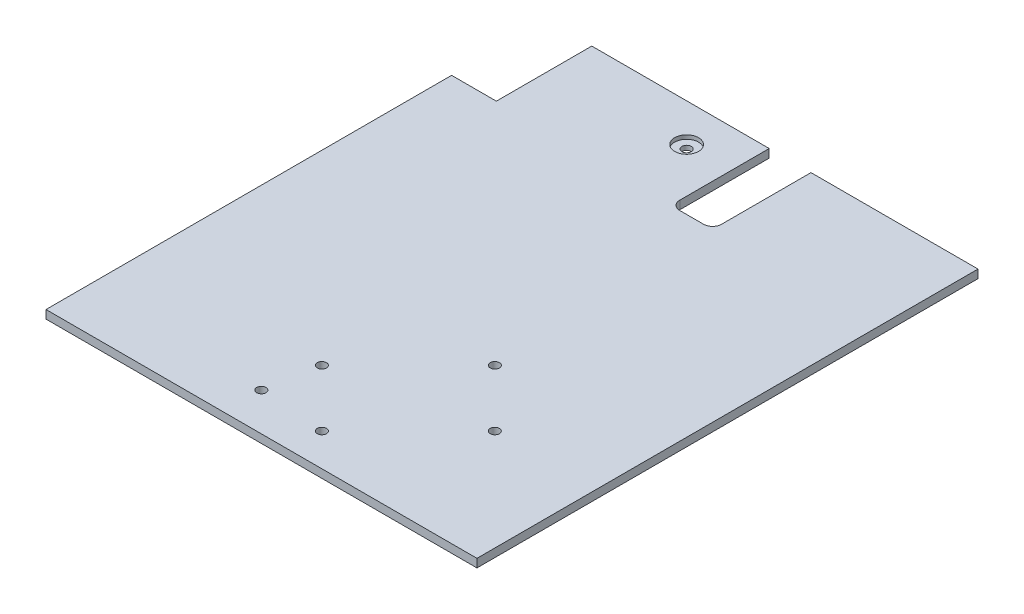
ISO-10303-21;
HEADER;
FILE_DESCRIPTION(('STEP AP214'),'2;1');
FILE_NAME('part.step','',(''),(''),'','','');
FILE_SCHEMA(('AUTOMOTIVE_DESIGN { 1 0 10303 214 1 1 1 1 }'));
ENDSEC;
DATA;
#1=APPLICATION_CONTEXT('core data for automotive mechanical design processes');
#2=APPLICATION_PROTOCOL_DEFINITION('international standard','automotive_design',2000,#1);
#3=PRODUCT_CONTEXT('',#1,'mechanical');
#4=PRODUCT('Part','Part','',(#3));
#5=PRODUCT_RELATED_PRODUCT_CATEGORY('part','',(#4));
#6=PRODUCT_DEFINITION_FORMATION('','',#4);
#7=PRODUCT_DEFINITION_CONTEXT('part definition',#1,'design');
#8=PRODUCT_DEFINITION('design','',#6,#7);
#9=PRODUCT_DEFINITION_SHAPE('','',#8);
#10=(LENGTH_UNIT() NAMED_UNIT(*) SI_UNIT(.MILLI.,.METRE.));
#11=(NAMED_UNIT(*) PLANE_ANGLE_UNIT() SI_UNIT($,.RADIAN.));
#12=(NAMED_UNIT(*) SI_UNIT($,.STERADIAN.) SOLID_ANGLE_UNIT());
#13=UNCERTAINTY_MEASURE_WITH_UNIT(LENGTH_MEASURE(1.E-05),#10,'distance_accuracy_value','');
#14=(GEOMETRIC_REPRESENTATION_CONTEXT(3) GLOBAL_UNCERTAINTY_ASSIGNED_CONTEXT((#13)) GLOBAL_UNIT_ASSIGNED_CONTEXT((#10,
#11,#12)) REPRESENTATION_CONTEXT('',''));
#15=CARTESIAN_POINT('',(0.,0.,0.));
#16=DIRECTION('',(0.,0.,1.));
#17=DIRECTION('',(1.,0.,0.));
#18=AXIS2_PLACEMENT_3D('',#15,#16,#17);
#19=CARTESIAN_POINT('',(0.,2.8,-84.));
#20=DIRECTION('',(0.,0.,-1.));
#21=DIRECTION('',(-1.,0.,0.));
#22=AXIS2_PLACEMENT_3D('',#19,#20,#21);
#23=PLANE('',#22);
#24=DIRECTION('',(0.,1.,0.));
#25=VECTOR('',#24,1.);
#26=CARTESIAN_POINT('',(16.25,-0.00100000000000013,-84.));
#27=LINE('',#26,#25);
#28=CARTESIAN_POINT('',(16.25,0.,-84.));
#29=VERTEX_POINT('',#28);
#30=CARTESIAN_POINT('',(16.25,2.8,-84.));
#31=VERTEX_POINT('',#30);
#32=EDGE_CURVE('E247',#29,#31,#27,.T.);
#33=ORIENTED_EDGE('',*,*,#32,.T.);
#34=DIRECTION('',(1.,0.,0.));
#35=VECTOR('',#34,1.);
#36=CARTESIAN_POINT('',(0.,2.8,-84.));
#37=LINE('',#36,#35);
#38=CARTESIAN_POINT('',(72.25,2.8,-84.));
#39=VERTEX_POINT('',#38);
#40=EDGE_CURVE('E59',#31,#39,#37,.T.);
#41=ORIENTED_EDGE('',*,*,#40,.T.);
#42=DIRECTION('',(0.,-1.,0.));
#43=VECTOR('',#42,1.);
#44=CARTESIAN_POINT('',(72.25,2.8,-84.));
#45=LINE('',#44,#43);
#46=CARTESIAN_POINT('',(72.25,0.,-84.));
#47=VERTEX_POINT('',#46);
#48=EDGE_CURVE('E138',#39,#47,#45,.T.);
#49=ORIENTED_EDGE('',*,*,#48,.T.);
#50=DIRECTION('',(1.,0.,0.));
#51=VECTOR('',#50,1.);
#52=CARTESIAN_POINT('',(0.,0.,-84.));
#53=LINE('',#52,#51);
#54=EDGE_CURVE('E86',#29,#47,#53,.T.);
#55=ORIENTED_EDGE('',*,*,#54,.F.);
#56=EDGE_LOOP('',(#33,#41,#49,#55));
#57=FACE_BOUND('',#56,.T.);
#58=ADVANCED_FACE('F34',(#57),#23,.T.);
#59=CARTESIAN_POINT('',(-12.75,-0.00100000000000013,-71.3));
#60=DIRECTION('',(0.,1.,0.));
#61=DIRECTION('',(0.,0.,1.));
#62=AXIS2_PLACEMENT_3D('',#59,#60,#61);
#63=CYLINDRICAL_SURFACE('',#62,1.54999999999999);
#64=CARTESIAN_POINT('',(-12.75,0.,-71.3));
#65=DIRECTION('',(0.,1.,0.));
#66=DIRECTION('',(0.,0.,1.));
#67=AXIS2_PLACEMENT_3D('',#64,#65,#66);
#68=CIRCLE('',#67,1.54999999999999);
#69=CARTESIAN_POINT('',(-12.75,0.,-69.75));
#70=VERTEX_POINT('',#69);
#71=EDGE_CURVE('E143',#70,#70,#68,.F.);
#72=ORIENTED_EDGE('',*,*,#71,.T.);
#73=EDGE_LOOP('',(#72));
#74=FACE_BOUND('',#73,.T.);
#75=CARTESIAN_POINT('',(-12.75,1.5,-71.3));
#76=DIRECTION('',(0.,1.,0.));
#77=DIRECTION('',(0.,0.,1.));
#78=AXIS2_PLACEMENT_3D('',#75,#76,#77);
#79=CIRCLE('',#78,1.54999999999999);
#80=CARTESIAN_POINT('',(-12.75,1.5,-69.75));
#81=VERTEX_POINT('',#80);
#82=EDGE_CURVE('E38',#81,#81,#79,.F.);
#83=ORIENTED_EDGE('',*,*,#82,.F.);
#84=EDGE_LOOP('',(#83));
#85=FACE_BOUND('',#84,.T.);
#86=ADVANCED_FACE('F317',(#74,#85),#63,.F.);
#87=DIRECTION('',(0.,1.,0.));
#88=VECTOR('',#87,1.);
#89=CARTESIAN_POINT('',(2.24999999999999,-0.00100000000000013,-84.));
#90=LINE('',#89,#88);
#91=CARTESIAN_POINT('',(2.24999999999999,0.,-84.));
#92=VERTEX_POINT('',#91);
#93=CARTESIAN_POINT('',(2.24999999999999,2.8,-84.));
#94=VERTEX_POINT('',#93);
#95=EDGE_CURVE('E207',#92,#94,#90,.T.);
#96=ORIENTED_EDGE('',*,*,#95,.F.);
#97=CARTESIAN_POINT('',(-57.25,0.,-84.));
#98=VERTEX_POINT('',#97);
#99=EDGE_CURVE('E152',#98,#92,#53,.T.);
#100=ORIENTED_EDGE('',*,*,#99,.F.);
#101=DIRECTION('',(0.,-1.,0.));
#102=VECTOR('',#101,1.);
#103=CARTESIAN_POINT('',(-57.25,2.8,-84.));
#104=LINE('',#103,#102);
#105=CARTESIAN_POINT('',(-57.25,2.8,-84.));
#106=VERTEX_POINT('',#105);
#107=EDGE_CURVE('E11',#106,#98,#104,.T.);
#108=ORIENTED_EDGE('',*,*,#107,.F.);
#109=EDGE_CURVE('E191',#106,#94,#37,.T.);
#110=ORIENTED_EDGE('',*,*,#109,.T.);
#111=EDGE_LOOP('',(#96,#100,#108,#110));
#112=FACE_BOUND('',#111,.T.);
#113=ADVANCED_FACE('F204',(#112),#23,.T.);
#114=CARTESIAN_POINT('',(-57.25,2.8,0.));
#115=DIRECTION('',(1.,0.,0.));
#116=DIRECTION('',(0.,0.,-1.));
#117=AXIS2_PLACEMENT_3D('',#114,#115,#116);
#118=PLANE('',#117);
#119=DIRECTION('',(0.,0.,1.));
#120=VECTOR('',#119,1.);
#121=CARTESIAN_POINT('',(-57.25,0.,0.));
#122=LINE('',#121,#120);
#123=CARTESIAN_POINT('',(-57.25,0.,-52.));
#124=VERTEX_POINT('',#123);
#125=EDGE_CURVE('E155',#98,#124,#122,.T.);
#126=ORIENTED_EDGE('',*,*,#125,.T.);
#127=DIRECTION('',(0.,-1.,0.));
#128=VECTOR('',#127,1.);
#129=CARTESIAN_POINT('',(-57.25,2.8,-52.));
#130=LINE('',#129,#128);
#131=CARTESIAN_POINT('',(-57.25,2.8,-52.));
#132=VERTEX_POINT('',#131);
#133=EDGE_CURVE('E43',#132,#124,#130,.T.);
#134=ORIENTED_EDGE('',*,*,#133,.F.);
#135=DIRECTION('',(0.,0.,1.));
#136=VECTOR('',#135,1.);
#137=CARTESIAN_POINT('',(-57.25,2.8,0.));
#138=LINE('',#137,#136);
#139=EDGE_CURVE('E133',#106,#132,#138,.T.);
#140=ORIENTED_EDGE('',*,*,#139,.F.);
#141=ORIENTED_EDGE('',*,*,#107,.T.);
#142=EDGE_LOOP('',(#126,#134,#140,#141));
#143=FACE_BOUND('',#142,.T.);
#144=ADVANCED_FACE('F177',(#143),#118,.F.);
#145=CARTESIAN_POINT('',(0.,2.8,-52.));
#146=DIRECTION('',(0.,0.,-1.));
#147=DIRECTION('',(-1.,0.,0.));
#148=AXIS2_PLACEMENT_3D('',#145,#146,#147);
#149=PLANE('',#148);
#150=DIRECTION('',(1.,0.,0.));
#151=VECTOR('',#150,1.);
#152=CARTESIAN_POINT('',(0.,0.,-52.));
#153=LINE('',#152,#151);
#154=CARTESIAN_POINT('',(-72.25,0.,-52.));
#155=VERTEX_POINT('',#154);
#156=EDGE_CURVE('E158',#155,#124,#153,.T.);
#157=ORIENTED_EDGE('',*,*,#156,.F.);
#158=DIRECTION('',(0.,-1.,0.));
#159=VECTOR('',#158,1.);
#160=CARTESIAN_POINT('',(-72.25,2.8,-52.));
#161=LINE('',#160,#159);
#162=CARTESIAN_POINT('',(-72.25,2.8,-52.));
#163=VERTEX_POINT('',#162);
#164=EDGE_CURVE('E115',#163,#155,#161,.T.);
#165=ORIENTED_EDGE('',*,*,#164,.F.);
#166=DIRECTION('',(1.,0.,0.));
#167=VECTOR('',#166,1.);
#168=CARTESIAN_POINT('',(0.,2.8,-52.));
#169=LINE('',#168,#167);
#170=EDGE_CURVE('E131',#163,#132,#169,.T.);
#171=ORIENTED_EDGE('',*,*,#170,.T.);
#172=ORIENTED_EDGE('',*,*,#133,.T.);
#173=EDGE_LOOP('',(#157,#165,#171,#172));
#174=FACE_BOUND('',#173,.T.);
#175=ADVANCED_FACE('F174',(#174),#149,.T.);
#176=CARTESIAN_POINT('',(-72.25,2.8,0.));
#177=DIRECTION('',(-1.,0.,0.));
#178=DIRECTION('',(0.,0.,1.));
#179=AXIS2_PLACEMENT_3D('',#176,#177,#178);
#180=PLANE('',#179);
#181=DIRECTION('',(0.,0.,-1.));
#182=VECTOR('',#181,1.);
#183=CARTESIAN_POINT('',(-72.25,0.,0.));
#184=LINE('',#183,#182);
#185=CARTESIAN_POINT('',(-72.25,0.,84.));
#186=VERTEX_POINT('',#185);
#187=EDGE_CURVE('E111',#186,#155,#184,.T.);
#188=ORIENTED_EDGE('',*,*,#187,.F.);
#189=DIRECTION('',(0.,-1.,0.));
#190=VECTOR('',#189,1.);
#191=CARTESIAN_POINT('',(-72.25,2.8,84.));
#192=LINE('',#191,#190);
#193=CARTESIAN_POINT('',(-72.25,2.8,84.));
#194=VERTEX_POINT('',#193);
#195=EDGE_CURVE('E105',#194,#186,#192,.T.);
#196=ORIENTED_EDGE('',*,*,#195,.F.);
#197=DIRECTION('',(0.,0.,-1.));
#198=VECTOR('',#197,1.);
#199=CARTESIAN_POINT('',(-72.25,2.8,0.));
#200=LINE('',#199,#198);
#201=EDGE_CURVE('E109',#194,#163,#200,.T.);
#202=ORIENTED_EDGE('',*,*,#201,.T.);
#203=ORIENTED_EDGE('',*,*,#164,.T.);
#204=EDGE_LOOP('',(#188,#196,#202,#203));
#205=FACE_BOUND('',#204,.T.);
#206=ADVANCED_FACE('F107',(#205),#180,.T.);
#207=CARTESIAN_POINT('',(0.,2.8,84.));
#208=DIRECTION('',(0.,0.,-1.));
#209=DIRECTION('',(-1.,0.,0.));
#210=AXIS2_PLACEMENT_3D('',#207,#208,#209);
#211=PLANE('',#210);
#212=DIRECTION('',(1.,0.,0.));
#213=VECTOR('',#212,1.);
#214=CARTESIAN_POINT('',(0.,0.,84.));
#215=LINE('',#214,#213);
#216=CARTESIAN_POINT('',(72.25,0.,84.));
#217=VERTEX_POINT('',#216);
#218=EDGE_CURVE('E162',#186,#217,#215,.T.);
#219=ORIENTED_EDGE('',*,*,#218,.T.);
#220=DIRECTION('',(0.,-1.,0.));
#221=VECTOR('',#220,1.);
#222=CARTESIAN_POINT('',(72.25,2.8,84.));
#223=LINE('',#222,#221);
#224=CARTESIAN_POINT('',(72.25,2.8,84.));
#225=VERTEX_POINT('',#224);
#226=EDGE_CURVE('E116',#225,#217,#223,.T.);
#227=ORIENTED_EDGE('',*,*,#226,.F.);
#228=DIRECTION('',(1.,0.,0.));
#229=VECTOR('',#228,1.);
#230=CARTESIAN_POINT('',(0.,2.8,84.));
#231=LINE('',#230,#229);
#232=EDGE_CURVE('E120',#194,#225,#231,.T.);
#233=ORIENTED_EDGE('',*,*,#232,.F.);
#234=ORIENTED_EDGE('',*,*,#195,.T.);
#235=EDGE_LOOP('',(#219,#227,#233,#234));
#236=FACE_BOUND('',#235,.T.);
#237=ADVANCED_FACE('F121',(#236),#211,.F.);
#238=CARTESIAN_POINT('',(19.1997474683059,2.8,24.9583694396574));
#239=DIRECTION('',(0.,-1.,0.));
#240=DIRECTION('',(0.,0.,-1.));
#241=AXIS2_PLACEMENT_3D('',#238,#239,#240);
#242=CYLINDRICAL_SURFACE('',#241,1.55);
#243=CARTESIAN_POINT('',(19.1997474683059,2.8,24.9583694396574));
#244=DIRECTION('',(0.,1.,0.));
#245=DIRECTION('',(0.,0.,1.));
#246=AXIS2_PLACEMENT_3D('',#243,#244,#245);
#247=CIRCLE('',#246,1.55);
#248=CARTESIAN_POINT('',(19.1997474683059,2.8,26.5083694396574));
#249=VERTEX_POINT('',#248);
#250=EDGE_CURVE('E192',#249,#249,#247,.T.);
#251=ORIENTED_EDGE('',*,*,#250,.T.);
#252=EDGE_LOOP('',(#251));
#253=FACE_BOUND('',#252,.T.);
#254=CARTESIAN_POINT('',(19.1997474683059,0.,24.9583694396574));
#255=DIRECTION('',(0.,1.,0.));
#256=DIRECTION('',(0.,0.,1.));
#257=AXIS2_PLACEMENT_3D('',#254,#255,#256);
#258=CIRCLE('',#257,1.55);
#259=CARTESIAN_POINT('',(19.1997474683059,0.,26.5083694396574));
#260=VERTEX_POINT('',#259);
#261=EDGE_CURVE('E149',#260,#260,#258,.T.);
#262=ORIENTED_EDGE('',*,*,#261,.F.);
#263=EDGE_LOOP('',(#262));
#264=FACE_BOUND('',#263,.T.);
#265=ADVANCED_FACE('F297',(#253,#264),#242,.F.);
#266=CARTESIAN_POINT('',(38.2916305603426,2.8,44.0502525316942));
#267=DIRECTION('',(0.,-1.,0.));
#268=DIRECTION('',(0.,0.,-1.));
#269=AXIS2_PLACEMENT_3D('',#266,#267,#268);
#270=CYLINDRICAL_SURFACE('',#269,1.55);
#271=CARTESIAN_POINT('',(38.2916305603426,2.8,44.0502525316942));
#272=DIRECTION('',(0.,1.,0.));
#273=DIRECTION('',(0.,0.,1.));
#274=AXIS2_PLACEMENT_3D('',#271,#272,#273);
#275=CIRCLE('',#274,1.55);
#276=CARTESIAN_POINT('',(38.2916305603426,2.8,45.6002525316942));
#277=VERTEX_POINT('',#276);
#278=EDGE_CURVE('E195',#277,#277,#275,.T.);
#279=ORIENTED_EDGE('',*,*,#278,.T.);
#280=EDGE_LOOP('',(#279));
#281=FACE_BOUND('',#280,.T.);
#282=CARTESIAN_POINT('',(38.2916305603426,0.,44.0502525316942));
#283=DIRECTION('',(0.,1.,0.));
#284=DIRECTION('',(0.,0.,1.));
#285=AXIS2_PLACEMENT_3D('',#282,#283,#284);
#286=CIRCLE('',#285,1.55);
#287=CARTESIAN_POINT('',(38.2916305603426,0.,45.6002525316942));
#288=VERTEX_POINT('',#287);
#289=EDGE_CURVE('E146',#288,#288,#286,.T.);
#290=ORIENTED_EDGE('',*,*,#289,.F.);
#291=EDGE_LOOP('',(#290));
#292=FACE_BOUND('',#291,.T.);
#293=ADVANCED_FACE('F289',(#281,#292),#270,.F.);
#294=CARTESIAN_POINT('',(-9.79163056034263,2.8,53.9497474683058));
#295=DIRECTION('',(0.,-1.,0.));
#296=DIRECTION('',(0.,0.,-1.));
#297=AXIS2_PLACEMENT_3D('',#294,#295,#296);
#298=CYLINDRICAL_SURFACE('',#297,1.55);
#299=CARTESIAN_POINT('',(-9.79163056034263,2.8,53.9497474683058));
#300=DIRECTION('',(0.,1.,0.));
#301=DIRECTION('',(0.,0.,1.));
#302=AXIS2_PLACEMENT_3D('',#299,#300,#301);
#303=CIRCLE('',#302,1.55);
#304=CARTESIAN_POINT('',(-9.79163056034263,2.8,55.4997474683058));
#305=VERTEX_POINT('',#304);
#306=EDGE_CURVE('E284',#305,#305,#303,.T.);
#307=ORIENTED_EDGE('',*,*,#306,.T.);
#308=EDGE_LOOP('',(#307));
#309=FACE_BOUND('',#308,.T.);
#310=CARTESIAN_POINT('',(-9.79163056034263,0.,53.9497474683058));
#311=DIRECTION('',(0.,1.,0.));
#312=DIRECTION('',(0.,0.,1.));
#313=AXIS2_PLACEMENT_3D('',#310,#311,#312);
#314=CIRCLE('',#313,1.55);
#315=CARTESIAN_POINT('',(-9.79163056034263,0.,55.4997474683058));
#316=VERTEX_POINT('',#315);
#317=EDGE_CURVE('E142',#316,#316,#314,.T.);
#318=ORIENTED_EDGE('',*,*,#317,.F.);
#319=EDGE_LOOP('',(#318));
#320=FACE_BOUND('',#319,.T.);
#321=ADVANCED_FACE('F341',(#309,#320),#298,.F.);
#322=CARTESIAN_POINT('',(9.30025253169412,2.8,73.0416305603426));
#323=DIRECTION('',(0.,-1.,0.));
#324=DIRECTION('',(0.,0.,-1.));
#325=AXIS2_PLACEMENT_3D('',#322,#323,#324);
#326=CYLINDRICAL_SURFACE('',#325,1.55);
#327=CARTESIAN_POINT('',(9.30025253169412,2.8,73.0416305603426));
#328=DIRECTION('',(0.,1.,0.));
#329=DIRECTION('',(0.,0.,1.));
#330=AXIS2_PLACEMENT_3D('',#327,#328,#329);
#331=CIRCLE('',#330,1.55);
#332=CARTESIAN_POINT('',(9.30025253169412,2.8,74.5916305603426));
#333=VERTEX_POINT('',#332);
#334=EDGE_CURVE('E167',#333,#333,#331,.T.);
#335=ORIENTED_EDGE('',*,*,#334,.T.);
#336=EDGE_LOOP('',(#335));
#337=FACE_BOUND('',#336,.T.);
#338=CARTESIAN_POINT('',(9.30025253169412,0.,73.0416305603426));
#339=DIRECTION('',(0.,1.,0.));
#340=DIRECTION('',(0.,0.,1.));
#341=AXIS2_PLACEMENT_3D('',#338,#339,#340);
#342=CIRCLE('',#341,1.55);
#343=CARTESIAN_POINT('',(9.30025253169412,0.,74.5916305603426));
#344=VERTEX_POINT('',#343);
#345=EDGE_CURVE('E139',#344,#344,#342,.T.);
#346=ORIENTED_EDGE('',*,*,#345,.F.);
#347=EDGE_LOOP('',(#346));
#348=FACE_BOUND('',#347,.T.);
#349=ADVANCED_FACE('F36',(#337,#348),#326,.F.);
#350=CARTESIAN_POINT('',(72.25,2.8,0.));
#351=DIRECTION('',(-1.,0.,0.));
#352=DIRECTION('',(0.,0.,1.));
#353=AXIS2_PLACEMENT_3D('',#350,#351,#352);
#354=PLANE('',#353);
#355=DIRECTION('',(0.,0.,-1.));
#356=VECTOR('',#355,1.);
#357=CARTESIAN_POINT('',(72.25,0.,0.));
#358=LINE('',#357,#356);
#359=EDGE_CURVE('E164',#217,#47,#358,.T.);
#360=ORIENTED_EDGE('',*,*,#359,.T.);
#361=ORIENTED_EDGE('',*,*,#48,.F.);
#362=DIRECTION('',(0.,0.,-1.));
#363=VECTOR('',#362,1.);
#364=CARTESIAN_POINT('',(72.25,2.8,0.));
#365=LINE('',#364,#363);
#366=EDGE_CURVE('E124',#225,#39,#365,.T.);
#367=ORIENTED_EDGE('',*,*,#366,.F.);
#368=ORIENTED_EDGE('',*,*,#226,.T.);
#369=EDGE_LOOP('',(#360,#361,#367,#368));
#370=FACE_BOUND('',#369,.T.);
#371=ADVANCED_FACE('F182',(#370),#354,.F.);
#372=CARTESIAN_POINT('',(0.,2.8,0.));
#373=DIRECTION('',(0.,1.,0.));
#374=DIRECTION('',(0.,0.,1.));
#375=AXIS2_PLACEMENT_3D('',#372,#373,#374);
#376=PLANE('',#375);
#377=DIRECTION('',(0.,0.,-1.));
#378=VECTOR('',#377,1.);
#379=CARTESIAN_POINT('',(16.25,2.8,-84.));
#380=LINE('',#379,#378);
#381=CARTESIAN_POINT('',(16.25,2.8,-54.));
#382=VERTEX_POINT('',#381);
#383=EDGE_CURVE('E187',#382,#31,#380,.T.);
#384=ORIENTED_EDGE('',*,*,#383,.F.);
#385=CARTESIAN_POINT('',(13.25,2.8,-54.));
#386=DIRECTION('',(0.,1.,0.));
#387=DIRECTION('',(0.,0.,-1.));
#388=AXIS2_PLACEMENT_3D('',#385,#386,#387);
#389=CIRCLE('',#388,3.);
#390=CARTESIAN_POINT('',(13.25,2.8,-51.));
#391=VERTEX_POINT('',#390);
#392=EDGE_CURVE('E240',#391,#382,#389,.T.);
#393=ORIENTED_EDGE('',*,*,#392,.F.);
#394=DIRECTION('',(1.,0.,0.));
#395=VECTOR('',#394,1.);
#396=CARTESIAN_POINT('',(13.25,2.8,-51.));
#397=LINE('',#396,#395);
#398=CARTESIAN_POINT('',(5.25,2.8,-51.));
#399=VERTEX_POINT('',#398);
#400=EDGE_CURVE('E259',#399,#391,#397,.T.);
#401=ORIENTED_EDGE('',*,*,#400,.F.);
#402=CARTESIAN_POINT('',(5.25,2.8,-54.));
#403=DIRECTION('',(0.,1.,0.));
#404=DIRECTION('',(0.,0.,1.));
#405=AXIS2_PLACEMENT_3D('',#402,#403,#404);
#406=CIRCLE('',#405,3.);
#407=CARTESIAN_POINT('',(2.25,2.8,-54.));
#408=VERTEX_POINT('',#407);
#409=EDGE_CURVE('E256',#408,#399,#406,.T.);
#410=ORIENTED_EDGE('',*,*,#409,.F.);
#411=DIRECTION('',(0.,0.,1.));
#412=VECTOR('',#411,1.);
#413=CARTESIAN_POINT('',(2.24999999999999,2.8,-84.));
#414=LINE('',#413,#412);
#415=EDGE_CURVE('E202',#94,#408,#414,.T.);
#416=ORIENTED_EDGE('',*,*,#415,.F.);
#417=ORIENTED_EDGE('',*,*,#109,.F.);
#418=ORIENTED_EDGE('',*,*,#139,.T.);
#419=ORIENTED_EDGE('',*,*,#170,.F.);
#420=ORIENTED_EDGE('',*,*,#201,.F.);
#421=ORIENTED_EDGE('',*,*,#232,.T.);
#422=ORIENTED_EDGE('',*,*,#366,.T.);
#423=ORIENTED_EDGE('',*,*,#40,.F.);
#424=EDGE_LOOP('',(#384,#393,#401,#410,#416,#417,#418,#419,#420,#421,#422,#423));
#425=FACE_BOUND('',#424,.T.);
#426=CARTESIAN_POINT('',(-12.75,2.8,-71.3));
#427=DIRECTION('',(0.,1.,0.));
#428=DIRECTION('',(0.,0.,1.));
#429=AXIS2_PLACEMENT_3D('',#426,#427,#428);
#430=CIRCLE('',#429,4.);
#431=CARTESIAN_POINT('',(-12.75,2.8,-67.3));
#432=VERTEX_POINT('',#431);
#433=EDGE_CURVE('E242',#432,#432,#430,.T.);
#434=ORIENTED_EDGE('',*,*,#433,.F.);
#435=EDGE_LOOP('',(#434));
#436=FACE_BOUND('',#435,.T.);
#437=CARTESIAN_POINT('',(-12.75,2.8,71.3));
#438=DIRECTION('',(0.,1.,0.));
#439=DIRECTION('',(0.,0.,1.));
#440=AXIS2_PLACEMENT_3D('',#437,#438,#439);
#441=CIRCLE('',#440,1.55);
#442=CARTESIAN_POINT('',(-12.75,2.8,72.85));
#443=VERTEX_POINT('',#442);
#444=EDGE_CURVE('E277',#443,#443,#441,.T.);
#445=ORIENTED_EDGE('',*,*,#444,.F.);
#446=EDGE_LOOP('',(#445));
#447=FACE_BOUND('',#446,.T.);
#448=ORIENTED_EDGE('',*,*,#334,.F.);
#449=EDGE_LOOP('',(#448));
#450=FACE_BOUND('',#449,.T.);
#451=ORIENTED_EDGE('',*,*,#306,.F.);
#452=EDGE_LOOP('',(#451));
#453=FACE_BOUND('',#452,.T.);
#454=ORIENTED_EDGE('',*,*,#278,.F.);
#455=EDGE_LOOP('',(#454));
#456=FACE_BOUND('',#455,.T.);
#457=ORIENTED_EDGE('',*,*,#250,.F.);
#458=EDGE_LOOP('',(#457));
#459=FACE_BOUND('',#458,.T.);
#460=ADVANCED_FACE('F128',(#425,#436,#447,#450,#453,#456,#459),#376,.T.);
#461=CARTESIAN_POINT('',(0.,0.,0.));
#462=DIRECTION('',(0.,1.,0.));
#463=DIRECTION('',(0.,0.,1.));
#464=AXIS2_PLACEMENT_3D('',#461,#462,#463);
#465=PLANE('',#464);
#466=ORIENTED_EDGE('',*,*,#71,.F.);
#467=EDGE_LOOP('',(#466));
#468=FACE_BOUND('',#467,.T.);
#469=CARTESIAN_POINT('',(-12.75,0.,71.3));
#470=DIRECTION('',(0.,1.,0.));
#471=DIRECTION('',(0.,0.,1.));
#472=AXIS2_PLACEMENT_3D('',#469,#470,#471);
#473=CIRCLE('',#472,1.55);
#474=CARTESIAN_POINT('',(-12.75,0.,72.85));
#475=VERTEX_POINT('',#474);
#476=EDGE_CURVE('E276',#475,#475,#473,.F.);
#477=ORIENTED_EDGE('',*,*,#476,.F.);
#478=EDGE_LOOP('',(#477));
#479=FACE_BOUND('',#478,.T.);
#480=ORIENTED_EDGE('',*,*,#345,.T.);
#481=EDGE_LOOP('',(#480));
#482=FACE_BOUND('',#481,.T.);
#483=ORIENTED_EDGE('',*,*,#317,.T.);
#484=EDGE_LOOP('',(#483));
#485=FACE_BOUND('',#484,.T.);
#486=ORIENTED_EDGE('',*,*,#289,.T.);
#487=EDGE_LOOP('',(#486));
#488=FACE_BOUND('',#487,.T.);
#489=ORIENTED_EDGE('',*,*,#261,.T.);
#490=EDGE_LOOP('',(#489));
#491=FACE_BOUND('',#490,.T.);
#492=CARTESIAN_POINT('',(13.25,0.,-54.));
#493=DIRECTION('',(0.,1.,0.));
#494=DIRECTION('',(0.,0.,1.));
#495=AXIS2_PLACEMENT_3D('',#492,#493,#494);
#496=CIRCLE('',#495,3.);
#497=CARTESIAN_POINT('',(16.25,0.,-54.));
#498=VERTEX_POINT('',#497);
#499=CARTESIAN_POINT('',(13.25,0.,-51.));
#500=VERTEX_POINT('',#499);
#501=EDGE_CURVE('E238',#498,#500,#496,.F.);
#502=ORIENTED_EDGE('',*,*,#501,.F.);
#503=DIRECTION('',(0.,0.,1.));
#504=VECTOR('',#503,1.);
#505=CARTESIAN_POINT('',(16.25,0.,-84.));
#506=LINE('',#505,#504);
#507=EDGE_CURVE('E245',#29,#498,#506,.T.);
#508=ORIENTED_EDGE('',*,*,#507,.F.);
#509=ORIENTED_EDGE('',*,*,#54,.T.);
#510=ORIENTED_EDGE('',*,*,#359,.F.);
#511=ORIENTED_EDGE('',*,*,#218,.F.);
#512=ORIENTED_EDGE('',*,*,#187,.T.);
#513=ORIENTED_EDGE('',*,*,#156,.T.);
#514=ORIENTED_EDGE('',*,*,#125,.F.);
#515=ORIENTED_EDGE('',*,*,#99,.T.);
#516=DIRECTION('',(0.,0.,-1.));
#517=VECTOR('',#516,1.);
#518=CARTESIAN_POINT('',(2.24999999999999,0.,-84.));
#519=LINE('',#518,#517);
#520=CARTESIAN_POINT('',(2.25,0.,-54.));
#521=VERTEX_POINT('',#520);
#522=EDGE_CURVE('E471',#521,#92,#519,.T.);
#523=ORIENTED_EDGE('',*,*,#522,.F.);
#524=CARTESIAN_POINT('',(5.25,0.,-54.));
#525=DIRECTION('',(0.,1.,0.));
#526=DIRECTION('',(0.,0.,1.));
#527=AXIS2_PLACEMENT_3D('',#524,#525,#526);
#528=CIRCLE('',#527,3.);
#529=CARTESIAN_POINT('',(5.25,0.,-51.));
#530=VERTEX_POINT('',#529);
#531=EDGE_CURVE('E50',#530,#521,#528,.F.);
#532=ORIENTED_EDGE('',*,*,#531,.F.);
#533=DIRECTION('',(-1.,0.,0.));
#534=VECTOR('',#533,1.);
#535=CARTESIAN_POINT('',(13.25,0.,-51.));
#536=LINE('',#535,#534);
#537=EDGE_CURVE('E249',#500,#530,#536,.T.);
#538=ORIENTED_EDGE('',*,*,#537,.F.);
#539=EDGE_LOOP('',(#502,#508,#509,#510,#511,#512,#513,#514,#515,#523,#532,#538));
#540=FACE_BOUND('',#539,.T.);
#541=ADVANCED_FACE('F179',(#468,#479,#482,#485,#488,#491,#540),#465,.F.);
#542=CARTESIAN_POINT('',(-12.75,-0.00100000000000013,71.3));
#543=DIRECTION('',(0.,1.,0.));
#544=DIRECTION('',(0.,0.,1.));
#545=AXIS2_PLACEMENT_3D('',#542,#543,#544);
#546=CYLINDRICAL_SURFACE('',#545,1.55);
#547=ORIENTED_EDGE('',*,*,#444,.T.);
#548=EDGE_LOOP('',(#547));
#549=FACE_BOUND('',#548,.T.);
#550=ORIENTED_EDGE('',*,*,#476,.T.);
#551=EDGE_LOOP('',(#550));
#552=FACE_BOUND('',#551,.T.);
#553=ADVANCED_FACE('F304',(#549,#552),#546,.F.);
#554=CARTESIAN_POINT('',(-12.75,1.5,-71.3));
#555=DIRECTION('',(0.,1.,0.));
#556=DIRECTION('',(0.,0.,1.));
#557=AXIS2_PLACEMENT_3D('',#554,#555,#556);
#558=PLANE('',#557);
#559=CARTESIAN_POINT('',(-12.75,1.5,-71.3));
#560=DIRECTION('',(0.,1.,0.));
#561=DIRECTION('',(0.,0.,1.));
#562=AXIS2_PLACEMENT_3D('',#559,#560,#561);
#563=CIRCLE('',#562,4.);
#564=CARTESIAN_POINT('',(-12.75,1.5,-67.3));
#565=VERTEX_POINT('',#564);
#566=EDGE_CURVE('E269',#565,#565,#563,.T.);
#567=ORIENTED_EDGE('',*,*,#566,.T.);
#568=EDGE_LOOP('',(#567));
#569=FACE_BOUND('',#568,.T.);
#570=ORIENTED_EDGE('',*,*,#82,.T.);
#571=EDGE_LOOP('',(#570));
#572=FACE_BOUND('',#571,.T.);
#573=ADVANCED_FACE('F310',(#569,#572),#558,.T.);
#574=CARTESIAN_POINT('',(-12.75,1.5,-71.3));
#575=DIRECTION('',(0.,1.,0.));
#576=DIRECTION('',(0.,0.,1.));
#577=AXIS2_PLACEMENT_3D('',#574,#575,#576);
#578=CYLINDRICAL_SURFACE('',#577,4.);
#579=ORIENTED_EDGE('',*,*,#566,.F.);
#580=EDGE_LOOP('',(#579));
#581=FACE_BOUND('',#580,.T.);
#582=ORIENTED_EDGE('',*,*,#433,.T.);
#583=EDGE_LOOP('',(#582));
#584=FACE_BOUND('',#583,.T.);
#585=ADVANCED_FACE('F396',(#581,#584),#578,.F.);
#586=CARTESIAN_POINT('',(16.25,-0.00100000000000013,-84.));
#587=DIRECTION('',(1.,0.,0.));
#588=DIRECTION('',(0.,0.,-1.));
#589=AXIS2_PLACEMENT_3D('',#586,#587,#588);
#590=PLANE('',#589);
#591=ORIENTED_EDGE('',*,*,#507,.T.);
#592=DIRECTION('',(0.,1.,0.));
#593=VECTOR('',#592,1.);
#594=CARTESIAN_POINT('',(16.25,-0.00100000000000013,-54.));
#595=LINE('',#594,#593);
#596=EDGE_CURVE('E235',#498,#382,#595,.T.);
#597=ORIENTED_EDGE('',*,*,#596,.T.);
#598=ORIENTED_EDGE('',*,*,#383,.T.);
#599=ORIENTED_EDGE('',*,*,#32,.F.);
#600=EDGE_LOOP('',(#591,#597,#598,#599));
#601=FACE_BOUND('',#600,.T.);
#602=ADVANCED_FACE('F246',(#601),#590,.F.);
#603=CARTESIAN_POINT('',(13.25,-0.00100000000000013,-54.));
#604=DIRECTION('',(0.,1.,0.));
#605=DIRECTION('',(0.,0.,1.));
#606=AXIS2_PLACEMENT_3D('',#603,#604,#605);
#607=CYLINDRICAL_SURFACE('',#606,3.);
#608=ORIENTED_EDGE('',*,*,#501,.T.);
#609=DIRECTION('',(0.,1.,0.));
#610=VECTOR('',#609,1.);
#611=CARTESIAN_POINT('',(13.25,-0.00100000000000013,-51.));
#612=LINE('',#611,#610);
#613=EDGE_CURVE('E230',#500,#391,#612,.T.);
#614=ORIENTED_EDGE('',*,*,#613,.T.);
#615=ORIENTED_EDGE('',*,*,#392,.T.);
#616=ORIENTED_EDGE('',*,*,#596,.F.);
#617=EDGE_LOOP('',(#608,#614,#615,#616));
#618=FACE_BOUND('',#617,.T.);
#619=ADVANCED_FACE('F237',(#618),#607,.F.);
#620=CARTESIAN_POINT('',(13.25,-0.00100000000000013,-51.));
#621=DIRECTION('',(0.,0.,1.));
#622=DIRECTION('',(1.,0.,0.));
#623=AXIS2_PLACEMENT_3D('',#620,#621,#622);
#624=PLANE('',#623);
#625=ORIENTED_EDGE('',*,*,#537,.T.);
#626=DIRECTION('',(0.,1.,0.));
#627=VECTOR('',#626,1.);
#628=CARTESIAN_POINT('',(5.25,-0.00100000000000013,-51.));
#629=LINE('',#628,#627);
#630=EDGE_CURVE('E263',#530,#399,#629,.T.);
#631=ORIENTED_EDGE('',*,*,#630,.T.);
#632=ORIENTED_EDGE('',*,*,#400,.T.);
#633=ORIENTED_EDGE('',*,*,#613,.F.);
#634=EDGE_LOOP('',(#625,#631,#632,#633));
#635=FACE_BOUND('',#634,.T.);
#636=ADVANCED_FACE('F440',(#635),#624,.F.);
#637=CARTESIAN_POINT('',(5.25,-0.00100000000000013,-54.));
#638=DIRECTION('',(0.,1.,0.));
#639=DIRECTION('',(0.,0.,1.));
#640=AXIS2_PLACEMENT_3D('',#637,#638,#639);
#641=CYLINDRICAL_SURFACE('',#640,3.);
#642=ORIENTED_EDGE('',*,*,#531,.T.);
#643=DIRECTION('',(0.,1.,0.));
#644=VECTOR('',#643,1.);
#645=CARTESIAN_POINT('',(2.25,-0.00100000000000013,-54.));
#646=LINE('',#645,#644);
#647=EDGE_CURVE('E265',#521,#408,#646,.T.);
#648=ORIENTED_EDGE('',*,*,#647,.T.);
#649=ORIENTED_EDGE('',*,*,#409,.T.);
#650=ORIENTED_EDGE('',*,*,#630,.F.);
#651=EDGE_LOOP('',(#642,#648,#649,#650));
#652=FACE_BOUND('',#651,.T.);
#653=ADVANCED_FACE('F449',(#652),#641,.F.);
#654=CARTESIAN_POINT('',(2.24999999999999,-0.00100000000000013,-84.));
#655=DIRECTION('',(-1.,0.,0.));
#656=DIRECTION('',(0.,0.,1.));
#657=AXIS2_PLACEMENT_3D('',#654,#655,#656);
#658=PLANE('',#657);
#659=ORIENTED_EDGE('',*,*,#522,.T.);
#660=ORIENTED_EDGE('',*,*,#95,.T.);
#661=ORIENTED_EDGE('',*,*,#415,.T.);
#662=ORIENTED_EDGE('',*,*,#647,.F.);
#663=EDGE_LOOP('',(#659,#660,#661,#662));
#664=FACE_BOUND('',#663,.T.);
#665=ADVANCED_FACE('F458',(#664),#658,.F.);
#666=CLOSED_SHELL('',(#58,#86,#113,#144,#175,#206,#237,#265,#293,#321,#349,#371,#460,#541,#553,
#573,#585,#602,#619,#636,#653,#665));
#667=MANIFOLD_SOLID_BREP('B2',#666);
#668=ADVANCED_BREP_SHAPE_REPRESENTATION('',(#18,#667),#14);
#669=SHAPE_DEFINITION_REPRESENTATION(#9,#668);
ENDSEC;
END-ISO-10303-21;
